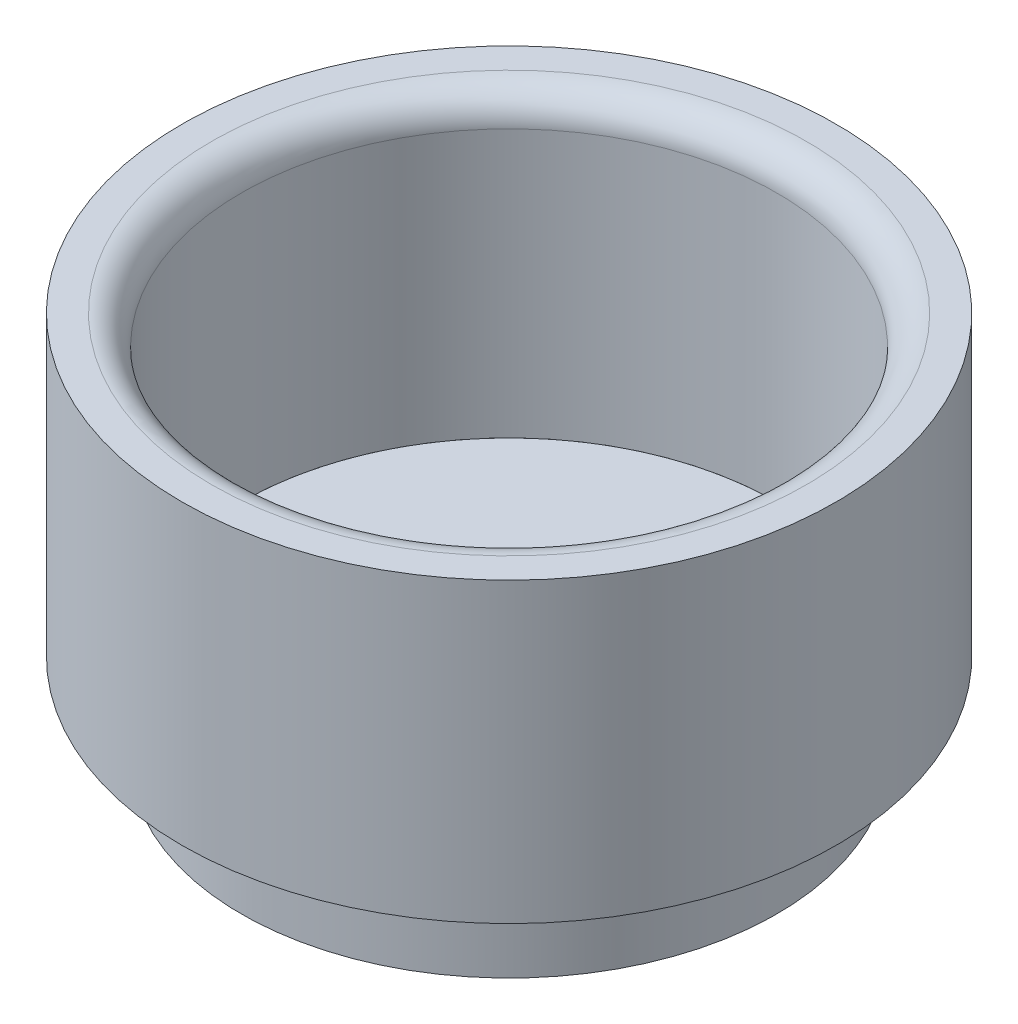
ISO-10303-21;
HEADER;
FILE_DESCRIPTION(('STEP AP214'),'2;1');
FILE_NAME('part.step','',(''),(''),'','','');
FILE_SCHEMA(('AUTOMOTIVE_DESIGN { 1 0 10303 214 1 1 1 1 }'));
ENDSEC;
DATA;
#1=APPLICATION_CONTEXT('core data for automotive mechanical design processes');
#2=APPLICATION_PROTOCOL_DEFINITION('international standard','automotive_design',2000,#1);
#3=PRODUCT_CONTEXT('',#1,'mechanical');
#4=PRODUCT('Part','Part','',(#3));
#5=PRODUCT_RELATED_PRODUCT_CATEGORY('part','',(#4));
#6=PRODUCT_DEFINITION_FORMATION('','',#4);
#7=PRODUCT_DEFINITION_CONTEXT('part definition',#1,'design');
#8=PRODUCT_DEFINITION('design','',#6,#7);
#9=PRODUCT_DEFINITION_SHAPE('','',#8);
#10=(LENGTH_UNIT() NAMED_UNIT(*) SI_UNIT(.MILLI.,.METRE.));
#11=(NAMED_UNIT(*) PLANE_ANGLE_UNIT() SI_UNIT($,.RADIAN.));
#12=(NAMED_UNIT(*) SI_UNIT($,.STERADIAN.) SOLID_ANGLE_UNIT());
#13=UNCERTAINTY_MEASURE_WITH_UNIT(LENGTH_MEASURE(1.E-05),#10,'distance_accuracy_value','');
#14=(GEOMETRIC_REPRESENTATION_CONTEXT(3) GLOBAL_UNCERTAINTY_ASSIGNED_CONTEXT((#13)) GLOBAL_UNIT_ASSIGNED_CONTEXT((#10,
#11,#12)) REPRESENTATION_CONTEXT('',''));
#15=CARTESIAN_POINT('',(0.,0.,0.));
#16=DIRECTION('',(0.,0.,1.));
#17=DIRECTION('',(1.,0.,0.));
#18=AXIS2_PLACEMENT_3D('',#15,#16,#17);
#19=CARTESIAN_POINT('',(0.,-3.,0.));
#20=DIRECTION('',(0.,1.,0.));
#21=DIRECTION('',(0.,0.,1.));
#22=AXIS2_PLACEMENT_3D('',#19,#20,#21);
#23=CYLINDRICAL_SURFACE('',#22,9.);
#24=CARTESIAN_POINT('',(0.,-3.,0.));
#25=DIRECTION('',(0.,-1.,0.));
#26=DIRECTION('',(0.,0.,-1.));
#27=AXIS2_PLACEMENT_3D('',#24,#25,#26);
#28=CIRCLE('',#27,9.);
#29=CARTESIAN_POINT('',(0.,-3.,-9.));
#30=VERTEX_POINT('',#29);
#31=EDGE_CURVE('E11',#30,#30,#28,.T.);
#32=ORIENTED_EDGE('',*,*,#31,.F.);
#33=EDGE_LOOP('',(#32));
#34=FACE_BOUND('',#33,.T.);
#35=CARTESIAN_POINT('',(0.,0.,0.));
#36=DIRECTION('',(0.,-1.,0.));
#37=DIRECTION('',(0.,0.,-1.));
#38=AXIS2_PLACEMENT_3D('',#35,#36,#37);
#39=CIRCLE('',#38,9.);
#40=CARTESIAN_POINT('',(0.,0.,-9.));
#41=VERTEX_POINT('',#40);
#42=EDGE_CURVE('E42',#41,#41,#39,.T.);
#43=ORIENTED_EDGE('',*,*,#42,.T.);
#44=EDGE_LOOP('',(#43));
#45=FACE_BOUND('',#44,.T.);
#46=ADVANCED_FACE('F39',(#34,#45),#23,.T.);
#47=CARTESIAN_POINT('',(0.,-3.,0.));
#48=DIRECTION('',(0.,-1.,0.));
#49=DIRECTION('',(0.,0.,-1.));
#50=AXIS2_PLACEMENT_3D('',#47,#48,#49);
#51=PLANE('',#50);
#52=ORIENTED_EDGE('',*,*,#31,.T.);
#53=EDGE_LOOP('',(#52));
#54=FACE_BOUND('',#53,.T.);
#55=ADVANCED_FACE('F54',(#54),#51,.T.);
#56=CARTESIAN_POINT('',(0.,0.,0.));
#57=DIRECTION('',(0.,-1.,0.));
#58=DIRECTION('',(0.,0.,-1.));
#59=AXIS2_PLACEMENT_3D('',#56,#57,#58);
#60=PLANE('',#59);
#61=ORIENTED_EDGE('',*,*,#42,.F.);
#62=EDGE_LOOP('',(#61));
#63=FACE_BOUND('',#62,.T.);
#64=ADVANCED_FACE('F52',(#63),#60,.F.);
#65=CLOSED_SHELL('',(#46,#55,#64));
#66=MANIFOLD_SOLID_BREP('B2',#65);
#67=CARTESIAN_POINT('',(0.,10.,0.));
#68=DIRECTION('',(0.,1.,0.));
#69=DIRECTION('',(0.,0.,1.));
#70=AXIS2_PLACEMENT_3D('',#67,#68,#69);
#71=PLANE('',#70);
#72=CARTESIAN_POINT('',(0.,10.,0.));
#73=DIRECTION('',(0.,1.,0.));
#74=DIRECTION('',(0.,0.,1.));
#75=AXIS2_PLACEMENT_3D('',#72,#73,#74);
#76=CIRCLE('',#75,10.);
#77=CARTESIAN_POINT('',(0.,10.,10.));
#78=VERTEX_POINT('',#77);
#79=EDGE_CURVE('E38',#78,#78,#76,.F.);
#80=ORIENTED_EDGE('',*,*,#79,.T.);
#81=EDGE_LOOP('',(#80));
#82=FACE_BOUND('',#81,.T.);
#83=CARTESIAN_POINT('',(0.,10.,0.));
#84=DIRECTION('',(0.,1.,0.));
#85=DIRECTION('',(0.,0.,1.));
#86=AXIS2_PLACEMENT_3D('',#83,#84,#85);
#87=CIRCLE('',#86,11.);
#88=CARTESIAN_POINT('',(0.,10.,11.));
#89=VERTEX_POINT('',#88);
#90=EDGE_CURVE('E91',#89,#89,#87,.T.);
#91=ORIENTED_EDGE('',*,*,#90,.T.);
#92=EDGE_LOOP('',(#91));
#93=FACE_BOUND('',#92,.T.);
#94=ADVANCED_FACE('F80',(#82,#93),#71,.T.);
#95=CARTESIAN_POINT('',(0.,0.,0.));
#96=DIRECTION('',(0.,1.,0.));
#97=DIRECTION('',(0.,0.,1.));
#98=AXIS2_PLACEMENT_3D('',#95,#96,#97);
#99=PLANE('',#98);
#100=CARTESIAN_POINT('',(0.,0.,0.));
#101=DIRECTION('',(0.,1.,0.));
#102=DIRECTION('',(0.,0.,1.));
#103=AXIS2_PLACEMENT_3D('',#100,#101,#102);
#104=CIRCLE('',#103,11.);
#105=CARTESIAN_POINT('',(0.,0.,11.));
#106=VERTEX_POINT('',#105);
#107=EDGE_CURVE('E95',#106,#106,#104,.T.);
#108=ORIENTED_EDGE('',*,*,#107,.F.);
#109=EDGE_LOOP('',(#108));
#110=FACE_BOUND('',#109,.T.);
#111=CARTESIAN_POINT('',(0.,0.,0.));
#112=DIRECTION('',(0.,1.,0.));
#113=DIRECTION('',(0.,0.,1.));
#114=AXIS2_PLACEMENT_3D('',#111,#112,#113);
#115=CIRCLE('',#114,9.);
#116=CARTESIAN_POINT('',(0.,0.,9.));
#117=VERTEX_POINT('',#116);
#118=EDGE_CURVE('E99',#117,#117,#115,.T.);
#119=ORIENTED_EDGE('',*,*,#118,.T.);
#120=EDGE_LOOP('',(#119));
#121=FACE_BOUND('',#120,.T.);
#122=ADVANCED_FACE('F104',(#110,#121),#99,.F.);
#123=CARTESIAN_POINT('',(0.,10.,0.));
#124=DIRECTION('',(0.,-1.,0.));
#125=DIRECTION('',(0.,0.,-1.));
#126=AXIS2_PLACEMENT_3D('',#123,#124,#125);
#127=CYLINDRICAL_SURFACE('',#126,11.);
#128=ORIENTED_EDGE('',*,*,#90,.F.);
#129=EDGE_LOOP('',(#128));
#130=FACE_BOUND('',#129,.T.);
#131=ORIENTED_EDGE('',*,*,#107,.T.);
#132=EDGE_LOOP('',(#131));
#133=FACE_BOUND('',#132,.T.);
#134=ADVANCED_FACE('F108',(#130,#133),#127,.T.);
#135=CARTESIAN_POINT('',(0.,10.,0.));
#136=DIRECTION('',(0.,-1.,0.));
#137=DIRECTION('',(0.,0.,-1.));
#138=AXIS2_PLACEMENT_3D('',#135,#136,#137);
#139=CYLINDRICAL_SURFACE('',#138,9.);
#140=CARTESIAN_POINT('',(0.,9.,0.));
#141=DIRECTION('',(0.,1.,0.));
#142=DIRECTION('',(0.,0.,1.));
#143=AXIS2_PLACEMENT_3D('',#140,#141,#142);
#144=CIRCLE('',#143,9.);
#145=CARTESIAN_POINT('',(0.,9.,9.));
#146=VERTEX_POINT('',#145);
#147=EDGE_CURVE('E87',#146,#146,#144,.T.);
#148=ORIENTED_EDGE('',*,*,#147,.T.);
#149=EDGE_LOOP('',(#148));
#150=FACE_BOUND('',#149,.T.);
#151=ORIENTED_EDGE('',*,*,#118,.F.);
#152=EDGE_LOOP('',(#151));
#153=FACE_BOUND('',#152,.T.);
#154=ADVANCED_FACE('F106',(#150,#153),#139,.F.);
#155=CARTESIAN_POINT('',(0.,9.,0.));
#156=DIRECTION('',(0.,1.,0.));
#157=DIRECTION('',(0.,0.,1.));
#158=AXIS2_PLACEMENT_3D('',#155,#156,#157);
#159=TOROIDAL_SURFACE('',#158,10.,1.);
#160=ORIENTED_EDGE('',*,*,#79,.F.);
#161=EDGE_LOOP('',(#160));
#162=FACE_BOUND('',#161,.T.);
#163=ORIENTED_EDGE('',*,*,#147,.F.);
#164=EDGE_LOOP('',(#163));
#165=FACE_BOUND('',#164,.T.);
#166=ADVANCED_FACE('F82',(#162,#165),#159,.T.);
#167=CLOSED_SHELL('',(#94,#122,#134,#154,#166));
#168=MANIFOLD_SOLID_BREP('B6',#167);
#169=ADVANCED_BREP_SHAPE_REPRESENTATION('',(#18,#66,#168),#14);
#170=SHAPE_DEFINITION_REPRESENTATION(#9,#169);
ENDSEC;
END-ISO-10303-21;
